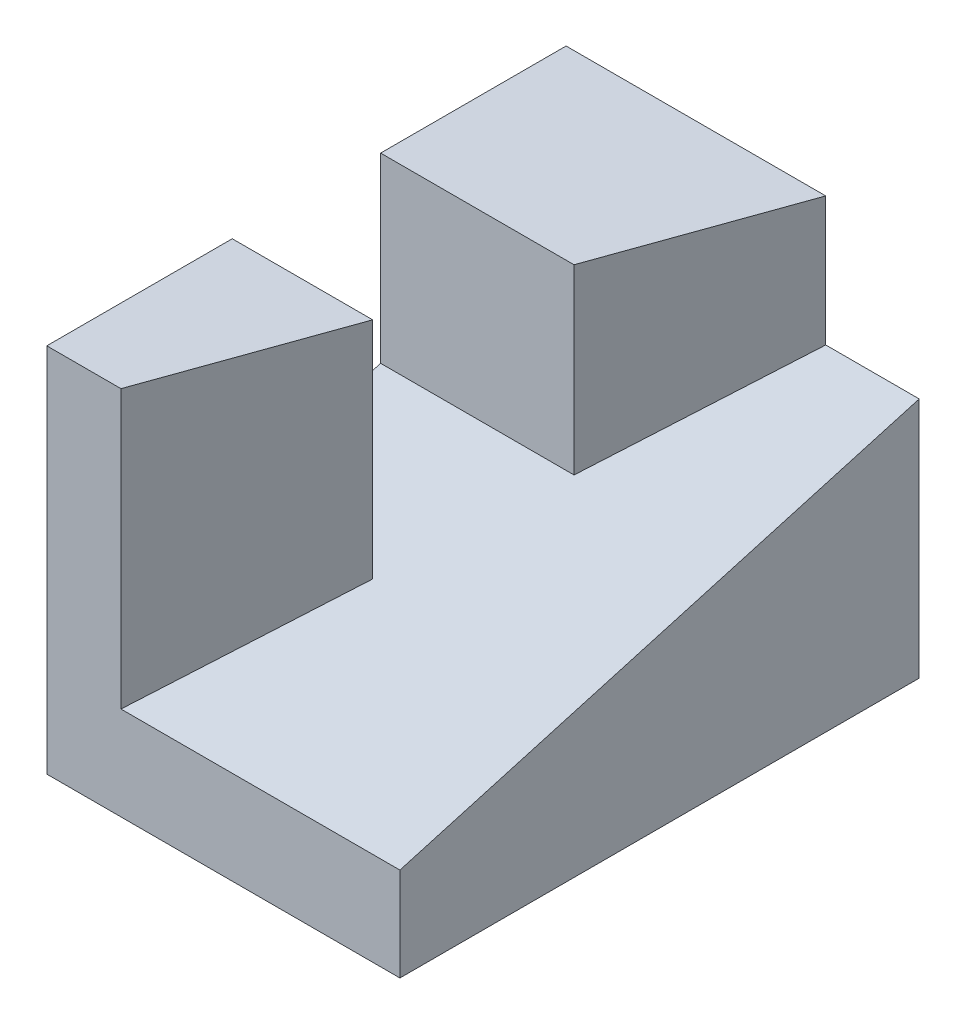
ISO-10303-21;
HEADER;
FILE_DESCRIPTION(('STEP AP214'),'2;1');
FILE_NAME('part.step','',(''),(''),'','','');
FILE_SCHEMA(('AUTOMOTIVE_DESIGN { 1 0 10303 214 1 1 1 1 }'));
ENDSEC;
DATA;
#1=APPLICATION_CONTEXT('core data for automotive mechanical design processes');
#2=APPLICATION_PROTOCOL_DEFINITION('international standard','automotive_design',2000,#1);
#3=PRODUCT_CONTEXT('',#1,'mechanical');
#4=PRODUCT('Part','Part','',(#3));
#5=PRODUCT_RELATED_PRODUCT_CATEGORY('part','',(#4));
#6=PRODUCT_DEFINITION_FORMATION('','',#4);
#7=PRODUCT_DEFINITION_CONTEXT('part definition',#1,'design');
#8=PRODUCT_DEFINITION('design','',#6,#7);
#9=PRODUCT_DEFINITION_SHAPE('','',#8);
#10=(LENGTH_UNIT() NAMED_UNIT(*) SI_UNIT(.MILLI.,.METRE.));
#11=(NAMED_UNIT(*) PLANE_ANGLE_UNIT() SI_UNIT($,.RADIAN.));
#12=(NAMED_UNIT(*) SI_UNIT($,.STERADIAN.) SOLID_ANGLE_UNIT());
#13=UNCERTAINTY_MEASURE_WITH_UNIT(LENGTH_MEASURE(1.E-05),#10,'distance_accuracy_value','');
#14=(GEOMETRIC_REPRESENTATION_CONTEXT(3) GLOBAL_UNCERTAINTY_ASSIGNED_CONTEXT((#13)) GLOBAL_UNIT_ASSIGNED_CONTEXT((#10,
#11,#12)) REPRESENTATION_CONTEXT('',''));
#15=CARTESIAN_POINT('',(0.,0.,0.));
#16=DIRECTION('',(0.,0.,1.));
#17=DIRECTION('',(1.,0.,0.));
#18=AXIS2_PLACEMENT_3D('',#15,#16,#17);
#19=CARTESIAN_POINT('',(63.5,14.7943018867924,4.22694339622641));
#20=DIRECTION('',(0.,-0.961523947640823,-0.274721127897378));
#21=DIRECTION('',(0.,0.274721127897378,-0.961523947640823));
#22=AXIS2_PLACEMENT_3D('',#19,#20,#21);
#23=PLANE('',#22);
#24=DIRECTION('',(1.,0.,0.));
#25=VECTOR('',#24,1.);
#26=CARTESIAN_POINT('',(63.5,32.3305714285714,-57.15));
#27=LINE('',#26,#25);
#28=CARTESIAN_POINT('',(0.,32.3305714285714,-57.15));
#29=VERTEX_POINT('',#28);
#30=CARTESIAN_POINT('',(33.1107142857143,32.3305714285714,-57.15));
#31=VERTEX_POINT('',#30);
#32=EDGE_CURVE('E11',#29,#31,#27,.T.);
#33=ORIENTED_EDGE('',*,*,#32,.F.);
#34=DIRECTION('',(0.,-0.274721127897378,0.961523947640823));
#35=VECTOR('',#34,1.);
#36=CARTESIAN_POINT('',(0.,14.7943018867924,4.22694339622641));
#37=LINE('',#36,#35);
#38=CARTESIAN_POINT('',(0.,25.0734285714286,-31.75));
#39=VERTEX_POINT('',#38);
#40=EDGE_CURVE('E188',#29,#39,#37,.T.);
#41=ORIENTED_EDGE('',*,*,#40,.T.);
#42=DIRECTION('',(1.,0.,0.));
#43=VECTOR('',#42,1.);
#44=CARTESIAN_POINT('',(63.5,25.0734285714286,-31.75));
#45=LINE('',#44,#43);
#46=CARTESIAN_POINT('',(24.0392857142857,25.0734285714286,-31.75));
#47=VERTEX_POINT('',#46);
#48=EDGE_CURVE('E225',#39,#47,#45,.T.);
#49=ORIENTED_EDGE('',*,*,#48,.T.);
#50=DIRECTION('',(-0.324784901230815,-0.259827920984652,0.909397723446283));
#51=VECTOR('',#50,1.);
#52=CARTESIAN_POINT('',(16.7082700421941,19.2086160337553,-11.2231561181435));
#53=LINE('',#52,#51);
#54=CARTESIAN_POINT('',(12.7,16.002,0.));
#55=VERTEX_POINT('',#54);
#56=EDGE_CURVE('E229',#47,#55,#53,.T.);
#57=ORIENTED_EDGE('',*,*,#56,.T.);
#58=DIRECTION('',(-1.,0.,0.));
#59=VECTOR('',#58,1.);
#60=CARTESIAN_POINT('',(63.5,16.002,0.));
#61=LINE('',#60,#59);
#62=CARTESIAN_POINT('',(60.452,16.002,0.));
#63=VERTEX_POINT('',#62);
#64=EDGE_CURVE('E195',#63,#55,#61,.T.);
#65=ORIENTED_EDGE('',*,*,#64,.F.);
#66=DIRECTION('',(0.,-0.274721127897378,0.961523947640823));
#67=VECTOR('',#66,1.);
#68=CARTESIAN_POINT('',(60.452,43.0697735849057,-94.7372075471698));
#69=LINE('',#68,#67);
#70=CARTESIAN_POINT('',(60.452,41.402,-88.9));
#71=VERTEX_POINT('',#70);
#72=EDGE_CURVE('E199',#71,#63,#69,.T.);
#73=ORIENTED_EDGE('',*,*,#72,.F.);
#74=DIRECTION('',(-1.,0.,0.));
#75=VECTOR('',#74,1.);
#76=CARTESIAN_POINT('',(63.5,41.402,-88.9));
#77=LINE('',#76,#75);
#78=CARTESIAN_POINT('',(44.45,41.402,-88.9));
#79=VERTEX_POINT('',#78);
#80=EDGE_CURVE('E191',#71,#79,#77,.T.);
#81=ORIENTED_EDGE('',*,*,#80,.T.);
#82=DIRECTION('',(-0.324784901230815,-0.259827920984652,0.909397723446283));
#83=VECTOR('',#82,1.);
#84=CARTESIAN_POINT('',(16.7082700421941,19.2086160337553,-11.2231561181435));
#85=LINE('',#84,#83);
#86=EDGE_CURVE('E54',#79,#31,#85,.T.);
#87=ORIENTED_EDGE('',*,*,#86,.T.);
#88=EDGE_LOOP('',(#33,#41,#49,#57,#65,#73,#81,#87));
#89=FACE_BOUND('',#88,.T.);
#90=ADVANCED_FACE('F45',(#89),#23,.F.);
#91=CARTESIAN_POINT('',(0.,63.5,-88.9));
#92=DIRECTION('',(1.,0.,0.));
#93=DIRECTION('',(0.,0.,-1.));
#94=AXIS2_PLACEMENT_3D('',#91,#92,#93);
#95=PLANE('',#94);
#96=DIRECTION('',(0.,0.,1.));
#97=VECTOR('',#96,1.);
#98=CARTESIAN_POINT('',(0.,0.,-88.9));
#99=LINE('',#98,#97);
#100=CARTESIAN_POINT('',(0.,0.,-88.9));
#101=VERTEX_POINT('',#100);
#102=CARTESIAN_POINT('',(0.,0.,0.));
#103=VERTEX_POINT('',#102);
#104=EDGE_CURVE('E203',#101,#103,#99,.T.);
#105=ORIENTED_EDGE('',*,*,#104,.T.);
#106=DIRECTION('',(0.,-1.,0.));
#107=VECTOR('',#106,1.);
#108=CARTESIAN_POINT('',(0.,63.5,0.));
#109=LINE('',#108,#107);
#110=CARTESIAN_POINT('',(0.,63.5,0.));
#111=VERTEX_POINT('',#110);
#112=EDGE_CURVE('E221',#111,#103,#109,.T.);
#113=ORIENTED_EDGE('',*,*,#112,.F.);
#114=DIRECTION('',(0.,0.,1.));
#115=VECTOR('',#114,1.);
#116=CARTESIAN_POINT('',(0.,63.5,0.));
#117=LINE('',#116,#115);
#118=CARTESIAN_POINT('',(0.,63.5,-31.75));
#119=VERTEX_POINT('',#118);
#120=EDGE_CURVE('E165',#119,#111,#117,.T.);
#121=ORIENTED_EDGE('',*,*,#120,.F.);
#122=DIRECTION('',(0.,-1.,0.));
#123=VECTOR('',#122,1.);
#124=CARTESIAN_POINT('',(0.,63.5,-31.75));
#125=LINE('',#124,#123);
#126=EDGE_CURVE('E179',#119,#39,#125,.T.);
#127=ORIENTED_EDGE('',*,*,#126,.T.);
#128=ORIENTED_EDGE('',*,*,#40,.F.);
#129=DIRECTION('',(0.,-1.,0.));
#130=VECTOR('',#129,1.);
#131=CARTESIAN_POINT('',(0.,63.5,-57.15));
#132=LINE('',#131,#130);
#133=CARTESIAN_POINT('',(0.,63.5,-57.15));
#134=VERTEX_POINT('',#133);
#135=EDGE_CURVE('E141',#134,#29,#132,.T.);
#136=ORIENTED_EDGE('',*,*,#135,.F.);
#137=DIRECTION('',(0.,0.,1.));
#138=VECTOR('',#137,1.);
#139=CARTESIAN_POINT('',(0.,63.5,0.));
#140=LINE('',#139,#138);
#141=CARTESIAN_POINT('',(0.,63.5,-88.9));
#142=VERTEX_POINT('',#141);
#143=EDGE_CURVE('E139',#142,#134,#140,.T.);
#144=ORIENTED_EDGE('',*,*,#143,.F.);
#145=DIRECTION('',(0.,-1.,0.));
#146=VECTOR('',#145,1.);
#147=CARTESIAN_POINT('',(0.,63.5,-88.9));
#148=LINE('',#147,#146);
#149=EDGE_CURVE('E124',#142,#101,#148,.T.);
#150=ORIENTED_EDGE('',*,*,#149,.T.);
#151=EDGE_LOOP('',(#105,#113,#121,#127,#128,#136,#144,#150));
#152=FACE_BOUND('',#151,.T.);
#153=ADVANCED_FACE('F47',(#152),#95,.F.);
#154=CARTESIAN_POINT('',(0.,63.5,0.));
#155=DIRECTION('',(0.,0.,-1.));
#156=DIRECTION('',(-1.,0.,0.));
#157=AXIS2_PLACEMENT_3D('',#154,#155,#156);
#158=PLANE('',#157);
#159=ORIENTED_EDGE('',*,*,#64,.T.);
#160=DIRECTION('',(0.,-1.,0.));
#161=VECTOR('',#160,1.);
#162=CARTESIAN_POINT('',(12.7,63.5,0.));
#163=LINE('',#162,#161);
#164=CARTESIAN_POINT('',(12.7,63.5,0.));
#165=VERTEX_POINT('',#164);
#166=EDGE_CURVE('E185',#165,#55,#163,.T.);
#167=ORIENTED_EDGE('',*,*,#166,.F.);
#168=DIRECTION('',(1.,0.,0.));
#169=VECTOR('',#168,1.);
#170=CARTESIAN_POINT('',(0.,63.5,0.));
#171=LINE('',#170,#169);
#172=EDGE_CURVE('E169',#111,#165,#171,.T.);
#173=ORIENTED_EDGE('',*,*,#172,.F.);
#174=ORIENTED_EDGE('',*,*,#112,.T.);
#175=DIRECTION('',(1.,0.,0.));
#176=VECTOR('',#175,1.);
#177=CARTESIAN_POINT('',(0.,0.,0.));
#178=LINE('',#177,#176);
#179=CARTESIAN_POINT('',(60.452,0.,0.));
#180=VERTEX_POINT('',#179);
#181=EDGE_CURVE('E206',#103,#180,#178,.T.);
#182=ORIENTED_EDGE('',*,*,#181,.T.);
#183=DIRECTION('',(0.,-1.,0.));
#184=VECTOR('',#183,1.);
#185=CARTESIAN_POINT('',(60.452,63.5,0.));
#186=LINE('',#185,#184);
#187=EDGE_CURVE('E217',#63,#180,#186,.T.);
#188=ORIENTED_EDGE('',*,*,#187,.F.);
#189=EDGE_LOOP('',(#159,#167,#173,#174,#182,#188));
#190=FACE_BOUND('',#189,.T.);
#191=ADVANCED_FACE('F251',(#190),#158,.F.);
#192=CARTESIAN_POINT('',(60.452,63.5,-88.9));
#193=DIRECTION('',(-1.,0.,0.));
#194=DIRECTION('',(0.,0.,1.));
#195=AXIS2_PLACEMENT_3D('',#192,#193,#194);
#196=PLANE('',#195);
#197=DIRECTION('',(0.,-1.,0.));
#198=VECTOR('',#197,1.);
#199=CARTESIAN_POINT('',(60.452,63.5,-88.9));
#200=LINE('',#199,#198);
#201=CARTESIAN_POINT('',(60.452,0.,-88.9));
#202=VERTEX_POINT('',#201);
#203=EDGE_CURVE('E136',#71,#202,#200,.T.);
#204=ORIENTED_EDGE('',*,*,#203,.F.);
#205=ORIENTED_EDGE('',*,*,#72,.T.);
#206=ORIENTED_EDGE('',*,*,#187,.T.);
#207=DIRECTION('',(0.,0.,-1.));
#208=VECTOR('',#207,1.);
#209=CARTESIAN_POINT('',(60.452,0.,-88.9));
#210=LINE('',#209,#208);
#211=EDGE_CURVE('E209',#180,#202,#210,.T.);
#212=ORIENTED_EDGE('',*,*,#211,.T.);
#213=EDGE_LOOP('',(#204,#205,#206,#212));
#214=FACE_BOUND('',#213,.T.);
#215=ADVANCED_FACE('F242',(#214),#196,.F.);
#216=CARTESIAN_POINT('',(0.,63.5,-88.9));
#217=DIRECTION('',(0.,0.,1.));
#218=DIRECTION('',(1.,0.,0.));
#219=AXIS2_PLACEMENT_3D('',#216,#217,#218);
#220=PLANE('',#219);
#221=DIRECTION('',(-1.,0.,0.));
#222=VECTOR('',#221,1.);
#223=CARTESIAN_POINT('',(0.,0.,-88.9));
#224=LINE('',#223,#222);
#225=EDGE_CURVE('E132',#202,#101,#224,.T.);
#226=ORIENTED_EDGE('',*,*,#225,.T.);
#227=ORIENTED_EDGE('',*,*,#149,.F.);
#228=DIRECTION('',(-1.,0.,0.));
#229=VECTOR('',#228,1.);
#230=CARTESIAN_POINT('',(0.,63.5,-88.9));
#231=LINE('',#230,#229);
#232=CARTESIAN_POINT('',(44.45,63.5,-88.9));
#233=VERTEX_POINT('',#232);
#234=EDGE_CURVE('E129',#233,#142,#231,.T.);
#235=ORIENTED_EDGE('',*,*,#234,.F.);
#236=DIRECTION('',(0.,-1.,0.));
#237=VECTOR('',#236,1.);
#238=CARTESIAN_POINT('',(44.45,63.5,-88.9));
#239=LINE('',#238,#237);
#240=EDGE_CURVE('E158',#233,#79,#239,.T.);
#241=ORIENTED_EDGE('',*,*,#240,.T.);
#242=ORIENTED_EDGE('',*,*,#80,.F.);
#243=ORIENTED_EDGE('',*,*,#203,.T.);
#244=EDGE_LOOP('',(#226,#227,#235,#241,#242,#243));
#245=FACE_BOUND('',#244,.T.);
#246=ADVANCED_FACE('F126',(#245),#220,.F.);
#247=CARTESIAN_POINT('',(0.,0.,0.));
#248=DIRECTION('',(0.,1.,0.));
#249=DIRECTION('',(0.,0.,1.));
#250=AXIS2_PLACEMENT_3D('',#247,#248,#249);
#251=PLANE('',#250);
#252=ORIENTED_EDGE('',*,*,#181,.F.);
#253=ORIENTED_EDGE('',*,*,#104,.F.);
#254=ORIENTED_EDGE('',*,*,#225,.F.);
#255=ORIENTED_EDGE('',*,*,#211,.F.);
#256=EDGE_LOOP('',(#252,#253,#254,#255));
#257=FACE_BOUND('',#256,.T.);
#258=ADVANCED_FACE('F247',(#257),#251,.F.);
#259=CARTESIAN_POINT('',(11.2633484162896,63.5,4.02262443438914));
#260=DIRECTION('',(0.941741911594837,0.,0.336336396998156));
#261=DIRECTION('',(0.336336396998156,0.,-0.941741911594837));
#262=AXIS2_PLACEMENT_3D('',#259,#260,#261);
#263=PLANE('',#262);
#264=ORIENTED_EDGE('',*,*,#56,.F.);
#265=DIRECTION('',(0.,-1.,0.));
#266=VECTOR('',#265,1.);
#267=CARTESIAN_POINT('',(24.0392857142857,63.5,-31.75));
#268=LINE('',#267,#266);
#269=CARTESIAN_POINT('',(24.0392857142857,63.5,-31.75));
#270=VERTEX_POINT('',#269);
#271=EDGE_CURVE('E68',#270,#47,#268,.T.);
#272=ORIENTED_EDGE('',*,*,#271,.F.);
#273=DIRECTION('',(-0.336336396998156,0.,0.941741911594837));
#274=VECTOR('',#273,1.);
#275=CARTESIAN_POINT('',(11.2633484162896,63.5,4.02262443438914));
#276=LINE('',#275,#274);
#277=EDGE_CURVE('E172',#270,#165,#276,.T.);
#278=ORIENTED_EDGE('',*,*,#277,.T.);
#279=ORIENTED_EDGE('',*,*,#166,.T.);
#280=EDGE_LOOP('',(#264,#272,#278,#279));
#281=FACE_BOUND('',#280,.T.);
#282=ADVANCED_FACE('F259',(#281),#263,.T.);
#283=CARTESIAN_POINT('',(0.,63.5,-31.75));
#284=DIRECTION('',(0.,0.,-1.));
#285=DIRECTION('',(-1.,0.,0.));
#286=AXIS2_PLACEMENT_3D('',#283,#284,#285);
#287=PLANE('',#286);
#288=ORIENTED_EDGE('',*,*,#48,.F.);
#289=ORIENTED_EDGE('',*,*,#126,.F.);
#290=DIRECTION('',(1.,0.,0.));
#291=VECTOR('',#290,1.);
#292=CARTESIAN_POINT('',(0.,63.5,-31.75));
#293=LINE('',#292,#291);
#294=EDGE_CURVE('E176',#119,#270,#293,.T.);
#295=ORIENTED_EDGE('',*,*,#294,.T.);
#296=ORIENTED_EDGE('',*,*,#271,.T.);
#297=EDGE_LOOP('',(#288,#289,#295,#296));
#298=FACE_BOUND('',#297,.T.);
#299=ADVANCED_FACE('F257',(#298),#287,.T.);
#300=CARTESIAN_POINT('',(0.,63.5,0.));
#301=DIRECTION('',(0.,1.,0.));
#302=DIRECTION('',(0.,0.,1.));
#303=AXIS2_PLACEMENT_3D('',#300,#301,#302);
#304=PLANE('',#303);
#305=ORIENTED_EDGE('',*,*,#120,.T.);
#306=ORIENTED_EDGE('',*,*,#172,.T.);
#307=ORIENTED_EDGE('',*,*,#277,.F.);
#308=ORIENTED_EDGE('',*,*,#294,.F.);
#309=EDGE_LOOP('',(#305,#306,#307,#308));
#310=FACE_BOUND('',#309,.T.);
#311=ADVANCED_FACE('F256',(#310),#304,.T.);
#312=CARTESIAN_POINT('',(0.,63.5,-57.15));
#313=DIRECTION('',(0.,0.,-1.));
#314=DIRECTION('',(-1.,0.,0.));
#315=AXIS2_PLACEMENT_3D('',#312,#313,#314);
#316=PLANE('',#315);
#317=ORIENTED_EDGE('',*,*,#135,.T.);
#318=ORIENTED_EDGE('',*,*,#32,.T.);
#319=DIRECTION('',(0.,-1.,0.));
#320=VECTOR('',#319,1.);
#321=CARTESIAN_POINT('',(33.1107142857143,63.5,-57.15));
#322=LINE('',#321,#320);
#323=CARTESIAN_POINT('',(33.1107142857143,63.5,-57.15));
#324=VERTEX_POINT('',#323);
#325=EDGE_CURVE('E61',#324,#31,#322,.T.);
#326=ORIENTED_EDGE('',*,*,#325,.F.);
#327=DIRECTION('',(1.,0.,0.));
#328=VECTOR('',#327,1.);
#329=CARTESIAN_POINT('',(0.,63.5,-57.15));
#330=LINE('',#329,#328);
#331=EDGE_CURVE('E145',#134,#324,#330,.T.);
#332=ORIENTED_EDGE('',*,*,#331,.F.);
#333=EDGE_LOOP('',(#317,#318,#326,#332));
#334=FACE_BOUND('',#333,.T.);
#335=ADVANCED_FACE('F313',(#334),#316,.F.);
#336=CARTESIAN_POINT('',(11.2633484162896,63.5,4.02262443438914));
#337=DIRECTION('',(0.941741911594837,0.,0.336336396998156));
#338=DIRECTION('',(0.336336396998156,0.,-0.941741911594837));
#339=AXIS2_PLACEMENT_3D('',#336,#337,#338);
#340=PLANE('',#339);
#341=ORIENTED_EDGE('',*,*,#86,.F.);
#342=ORIENTED_EDGE('',*,*,#240,.F.);
#343=DIRECTION('',(-0.336336396998156,0.,0.941741911594837));
#344=VECTOR('',#343,1.);
#345=CARTESIAN_POINT('',(11.2633484162896,63.5,4.02262443438914));
#346=LINE('',#345,#344);
#347=EDGE_CURVE('E148',#233,#324,#346,.T.);
#348=ORIENTED_EDGE('',*,*,#347,.T.);
#349=ORIENTED_EDGE('',*,*,#325,.T.);
#350=EDGE_LOOP('',(#341,#342,#348,#349));
#351=FACE_BOUND('',#350,.T.);
#352=ADVANCED_FACE('F239',(#351),#340,.T.);
#353=CARTESIAN_POINT('',(0.,63.5,0.));
#354=DIRECTION('',(0.,1.,0.));
#355=DIRECTION('',(0.,0.,1.));
#356=AXIS2_PLACEMENT_3D('',#353,#354,#355);
#357=PLANE('',#356);
#358=ORIENTED_EDGE('',*,*,#234,.T.);
#359=ORIENTED_EDGE('',*,*,#143,.T.);
#360=ORIENTED_EDGE('',*,*,#331,.T.);
#361=ORIENTED_EDGE('',*,*,#347,.F.);
#362=EDGE_LOOP('',(#358,#359,#360,#361));
#363=FACE_BOUND('',#362,.T.);
#364=ADVANCED_FACE('F147',(#363),#357,.T.);
#365=CLOSED_SHELL('',(#90,#153,#191,#215,#246,#258,#282,#299,#311,#335,#352,#364));
#366=MANIFOLD_SOLID_BREP('B2',#365);
#367=ADVANCED_BREP_SHAPE_REPRESENTATION('',(#18,#366),#14);
#368=SHAPE_DEFINITION_REPRESENTATION(#9,#367);
ENDSEC;
END-ISO-10303-21;
